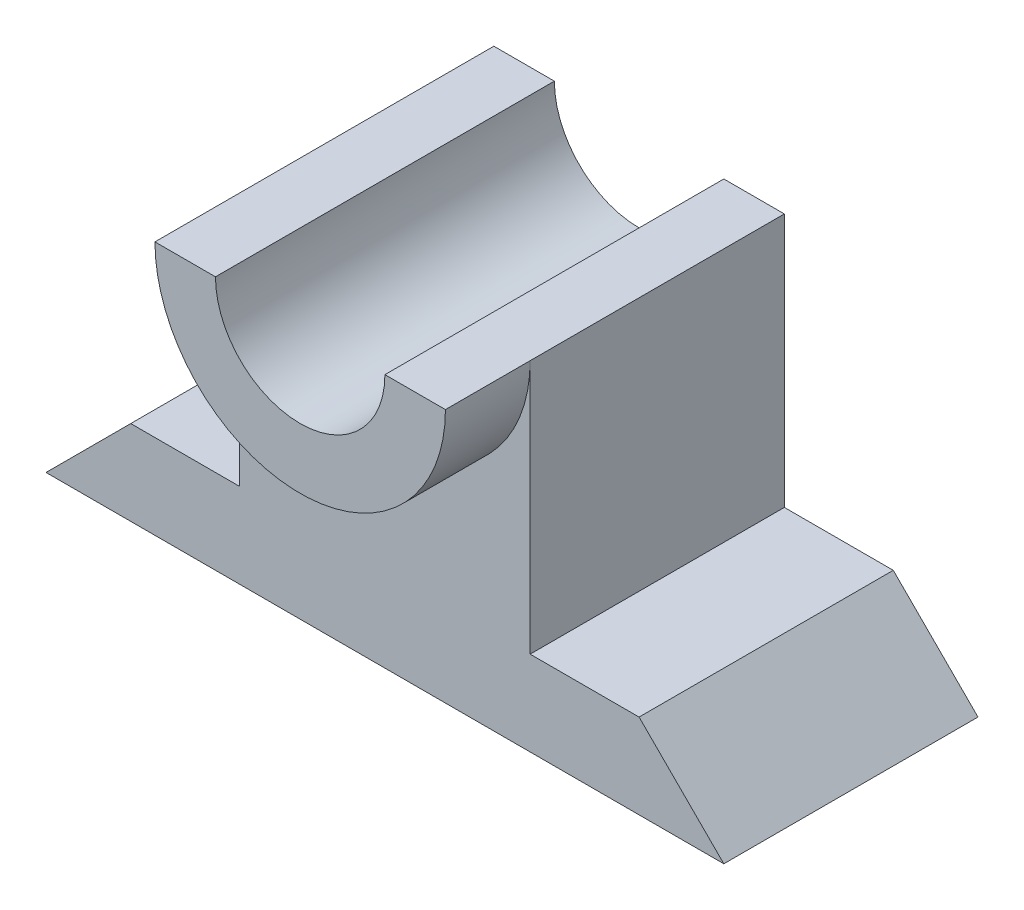
ISO-10303-21;
HEADER;
FILE_DESCRIPTION(('STEP AP214'),'2;1');
FILE_NAME('part.step','',(''),(''),'','','');
FILE_SCHEMA(('AUTOMOTIVE_DESIGN { 1 0 10303 214 1 1 1 1 }'));
ENDSEC;
DATA;
#1=APPLICATION_CONTEXT('core data for automotive mechanical design processes');
#2=APPLICATION_PROTOCOL_DEFINITION('international standard','automotive_design',2000,#1);
#3=PRODUCT_CONTEXT('',#1,'mechanical');
#4=PRODUCT('Part','Part','',(#3));
#5=PRODUCT_RELATED_PRODUCT_CATEGORY('part','',(#4));
#6=PRODUCT_DEFINITION_FORMATION('','',#4);
#7=PRODUCT_DEFINITION_CONTEXT('part definition',#1,'design');
#8=PRODUCT_DEFINITION('design','',#6,#7);
#9=PRODUCT_DEFINITION_SHAPE('','',#8);
#10=(LENGTH_UNIT() NAMED_UNIT(*) SI_UNIT(.MILLI.,.METRE.));
#11=(NAMED_UNIT(*) PLANE_ANGLE_UNIT() SI_UNIT($,.RADIAN.));
#12=(NAMED_UNIT(*) SI_UNIT($,.STERADIAN.) SOLID_ANGLE_UNIT());
#13=UNCERTAINTY_MEASURE_WITH_UNIT(LENGTH_MEASURE(1.E-05),#10,'distance_accuracy_value','');
#14=(GEOMETRIC_REPRESENTATION_CONTEXT(3) GLOBAL_UNCERTAINTY_ASSIGNED_CONTEXT((#13)) GLOBAL_UNIT_ASSIGNED_CONTEXT((#10,
#11,#12)) REPRESENTATION_CONTEXT('',''));
#15=CARTESIAN_POINT('',(0.,0.,0.));
#16=DIRECTION('',(0.,0.,1.));
#17=DIRECTION('',(1.,0.,0.));
#18=AXIS2_PLACEMENT_3D('',#15,#16,#17);
#19=CARTESIAN_POINT('',(17.1428571428571,0.,-30.));
#20=DIRECTION('',(1.,0.,0.));
#21=DIRECTION('',(0.,1.,0.));
#22=AXIS2_PLACEMENT_3D('',#19,#20,#21);
#23=PLANE('',#22);
#24=DIRECTION('',(0.,1.,0.));
#25=VECTOR('',#24,1.);
#26=CARTESIAN_POINT('',(17.1428571428571,0.,0.));
#27=LINE('',#26,#25);
#28=CARTESIAN_POINT('',(17.1428571428571,9.99999999999998,0.));
#29=VERTEX_POINT('',#28);
#30=CARTESIAN_POINT('',(17.1428571428572,40.,0.));
#31=VERTEX_POINT('',#30);
#32=EDGE_CURVE('E149',#29,#31,#27,.T.);
#33=ORIENTED_EDGE('',*,*,#32,.F.);
#34=DIRECTION('',(0.,0.,1.));
#35=VECTOR('',#34,1.);
#36=CARTESIAN_POINT('',(17.1428571428571,9.99999999999998,-30.));
#37=LINE('',#36,#35);
#38=CARTESIAN_POINT('',(17.1428571428571,9.99999999999998,-30.));
#39=VERTEX_POINT('',#38);
#40=EDGE_CURVE('E11',#39,#29,#37,.T.);
#41=ORIENTED_EDGE('',*,*,#40,.F.);
#42=DIRECTION('',(0.,1.,0.));
#43=VECTOR('',#42,1.);
#44=CARTESIAN_POINT('',(17.1428571428571,0.,-30.));
#45=LINE('',#44,#43);
#46=CARTESIAN_POINT('',(17.1428571428572,40.,-30.));
#47=VERTEX_POINT('',#46);
#48=EDGE_CURVE('E172',#39,#47,#45,.T.);
#49=ORIENTED_EDGE('',*,*,#48,.T.);
#50=DIRECTION('',(0.,0.,1.));
#51=VECTOR('',#50,1.);
#52=CARTESIAN_POINT('',(17.1428571428572,40.,-30.));
#53=LINE('',#52,#51);
#54=EDGE_CURVE('E42',#47,#31,#53,.T.);
#55=ORIENTED_EDGE('',*,*,#54,.T.);
#56=EDGE_LOOP('',(#33,#41,#49,#55));
#57=FACE_BOUND('',#56,.T.);
#58=ADVANCED_FACE('F39',(#57),#23,.T.);
#59=CARTESIAN_POINT('',(0.,9.99999999999999,-30.));
#60=DIRECTION('',(0.,1.,0.));
#61=DIRECTION('',(-1.,0.,0.));
#62=AXIS2_PLACEMENT_3D('',#59,#60,#61);
#63=PLANE('',#62);
#64=DIRECTION('',(-1.,0.,0.));
#65=VECTOR('',#64,1.);
#66=CARTESIAN_POINT('',(0.,9.99999999999999,0.));
#67=LINE('',#66,#65);
#68=CARTESIAN_POINT('',(30.,9.99999999999997,0.));
#69=VERTEX_POINT('',#68);
#70=EDGE_CURVE('E169',#69,#29,#67,.T.);
#71=ORIENTED_EDGE('',*,*,#70,.F.);
#72=DIRECTION('',(0.,0.,1.));
#73=VECTOR('',#72,1.);
#74=CARTESIAN_POINT('',(30.,9.99999999999997,-30.));
#75=LINE('',#74,#73);
#76=CARTESIAN_POINT('',(30.,9.99999999999997,-30.));
#77=VERTEX_POINT('',#76);
#78=EDGE_CURVE('E49',#77,#69,#75,.T.);
#79=ORIENTED_EDGE('',*,*,#78,.F.);
#80=DIRECTION('',(-1.,0.,0.));
#81=VECTOR('',#80,1.);
#82=CARTESIAN_POINT('',(0.,9.99999999999999,-30.));
#83=LINE('',#82,#81);
#84=EDGE_CURVE('E134',#77,#39,#83,.T.);
#85=ORIENTED_EDGE('',*,*,#84,.T.);
#86=ORIENTED_EDGE('',*,*,#40,.T.);
#87=EDGE_LOOP('',(#71,#79,#85,#86));
#88=FACE_BOUND('',#87,.T.);
#89=ADVANCED_FACE('F281',(#88),#63,.T.);
#90=CARTESIAN_POINT('',(19.9999999999999,20.,-30.));
#91=DIRECTION('',(0.707106781186546,0.707106781186549,0.));
#92=DIRECTION('',(-0.707106781186549,0.707106781186546,0.));
#93=AXIS2_PLACEMENT_3D('',#90,#91,#92);
#94=PLANE('',#93);
#95=DIRECTION('',(-0.707106781186549,0.707106781186546,0.));
#96=VECTOR('',#95,1.);
#97=CARTESIAN_POINT('',(19.9999999999999,20.,0.));
#98=LINE('',#97,#96);
#99=CARTESIAN_POINT('',(40.,0.,0.));
#100=VERTEX_POINT('',#99);
#101=EDGE_CURVE('E122',#100,#69,#98,.T.);
#102=ORIENTED_EDGE('',*,*,#101,.F.);
#103=DIRECTION('',(0.,0.,1.));
#104=VECTOR('',#103,1.);
#105=CARTESIAN_POINT('',(40.,0.,-30.));
#106=LINE('',#105,#104);
#107=CARTESIAN_POINT('',(40.,0.,-30.));
#108=VERTEX_POINT('',#107);
#109=EDGE_CURVE('E117',#108,#100,#106,.T.);
#110=ORIENTED_EDGE('',*,*,#109,.F.);
#111=DIRECTION('',(-0.707106781186549,0.707106781186546,0.));
#112=VECTOR('',#111,1.);
#113=CARTESIAN_POINT('',(19.9999999999999,20.,-30.));
#114=LINE('',#113,#112);
#115=EDGE_CURVE('E120',#108,#77,#114,.T.);
#116=ORIENTED_EDGE('',*,*,#115,.T.);
#117=ORIENTED_EDGE('',*,*,#78,.T.);
#118=EDGE_LOOP('',(#102,#110,#116,#117));
#119=FACE_BOUND('',#118,.T.);
#120=ADVANCED_FACE('F119',(#119),#94,.T.);
#121=CARTESIAN_POINT('',(0.,0.,-30.));
#122=DIRECTION('',(0.,-1.,0.));
#123=DIRECTION('',(0.,0.,-1.));
#124=AXIS2_PLACEMENT_3D('',#121,#122,#123);
#125=PLANE('',#124);
#126=DIRECTION('',(1.,0.,0.));
#127=VECTOR('',#126,1.);
#128=CARTESIAN_POINT('',(0.,0.,0.));
#129=LINE('',#128,#127);
#130=CARTESIAN_POINT('',(-40.,0.,0.));
#131=VERTEX_POINT('',#130);
#132=EDGE_CURVE('E164',#131,#100,#129,.T.);
#133=ORIENTED_EDGE('',*,*,#132,.F.);
#134=DIRECTION('',(0.,0.,1.));
#135=VECTOR('',#134,1.);
#136=CARTESIAN_POINT('',(-40.,0.,-30.));
#137=LINE('',#136,#135);
#138=CARTESIAN_POINT('',(-40.,0.,-30.));
#139=VERTEX_POINT('',#138);
#140=EDGE_CURVE('E128',#139,#131,#137,.T.);
#141=ORIENTED_EDGE('',*,*,#140,.F.);
#142=DIRECTION('',(1.,0.,0.));
#143=VECTOR('',#142,1.);
#144=CARTESIAN_POINT('',(0.,0.,-30.));
#145=LINE('',#144,#143);
#146=EDGE_CURVE('E133',#139,#108,#145,.T.);
#147=ORIENTED_EDGE('',*,*,#146,.T.);
#148=ORIENTED_EDGE('',*,*,#109,.T.);
#149=EDGE_LOOP('',(#133,#141,#147,#148));
#150=FACE_BOUND('',#149,.T.);
#151=ADVANCED_FACE('F137',(#150),#125,.T.);
#152=CARTESIAN_POINT('',(-19.9999999999999,20.,-30.));
#153=DIRECTION('',(0.707106781186546,-0.707106781186549,0.));
#154=DIRECTION('',(0.707106781186549,0.707106781186546,0.));
#155=AXIS2_PLACEMENT_3D('',#152,#153,#154);
#156=PLANE('',#155);
#157=DIRECTION('',(0.707106781186549,0.707106781186546,0.));
#158=VECTOR('',#157,1.);
#159=CARTESIAN_POINT('',(-19.9999999999999,20.,0.));
#160=LINE('',#159,#158);
#161=CARTESIAN_POINT('',(-30.,9.99999999999997,0.));
#162=VERTEX_POINT('',#161);
#163=EDGE_CURVE('E161',#131,#162,#160,.T.);
#164=ORIENTED_EDGE('',*,*,#163,.T.);
#165=DIRECTION('',(0.,0.,1.));
#166=VECTOR('',#165,1.);
#167=CARTESIAN_POINT('',(-30.,9.99999999999997,-30.));
#168=LINE('',#167,#166);
#169=CARTESIAN_POINT('',(-30.,9.99999999999997,-30.));
#170=VERTEX_POINT('',#169);
#171=EDGE_CURVE('E178',#170,#162,#168,.T.);
#172=ORIENTED_EDGE('',*,*,#171,.F.);
#173=DIRECTION('',(0.707106781186549,0.707106781186546,0.));
#174=VECTOR('',#173,1.);
#175=CARTESIAN_POINT('',(-19.9999999999999,20.,-30.));
#176=LINE('',#175,#174);
#177=EDGE_CURVE('E140',#139,#170,#176,.T.);
#178=ORIENTED_EDGE('',*,*,#177,.F.);
#179=ORIENTED_EDGE('',*,*,#140,.T.);
#180=EDGE_LOOP('',(#164,#172,#178,#179));
#181=FACE_BOUND('',#180,.T.);
#182=ADVANCED_FACE('F295',(#181),#156,.F.);
#183=CARTESIAN_POINT('',(0.,9.99999999999999,-30.));
#184=DIRECTION('',(0.,-1.,0.));
#185=DIRECTION('',(1.,0.,0.));
#186=AXIS2_PLACEMENT_3D('',#183,#184,#185);
#187=PLANE('',#186);
#188=DIRECTION('',(1.,0.,0.));
#189=VECTOR('',#188,1.);
#190=CARTESIAN_POINT('',(0.,9.99999999999999,0.));
#191=LINE('',#190,#189);
#192=CARTESIAN_POINT('',(-17.1428571428571,9.99999999999998,0.));
#193=VERTEX_POINT('',#192);
#194=EDGE_CURVE('E158',#162,#193,#191,.T.);
#195=ORIENTED_EDGE('',*,*,#194,.T.);
#196=DIRECTION('',(0.,0.,1.));
#197=VECTOR('',#196,1.);
#198=CARTESIAN_POINT('',(-17.1428571428571,9.99999999999998,-30.));
#199=LINE('',#198,#197);
#200=CARTESIAN_POINT('',(-17.1428571428571,9.99999999999998,-30.));
#201=VERTEX_POINT('',#200);
#202=EDGE_CURVE('E182',#201,#193,#199,.T.);
#203=ORIENTED_EDGE('',*,*,#202,.F.);
#204=DIRECTION('',(1.,0.,0.));
#205=VECTOR('',#204,1.);
#206=CARTESIAN_POINT('',(0.,9.99999999999999,-30.));
#207=LINE('',#206,#205);
#208=EDGE_CURVE('E143',#170,#201,#207,.T.);
#209=ORIENTED_EDGE('',*,*,#208,.F.);
#210=ORIENTED_EDGE('',*,*,#171,.T.);
#211=EDGE_LOOP('',(#195,#203,#209,#210));
#212=FACE_BOUND('',#211,.T.);
#213=ADVANCED_FACE('F247',(#212),#187,.F.);
#214=CARTESIAN_POINT('',(-17.1428571428571,0.,-30.));
#215=DIRECTION('',(1.,0.,0.));
#216=DIRECTION('',(0.,1.,0.));
#217=AXIS2_PLACEMENT_3D('',#214,#215,#216);
#218=PLANE('',#217);
#219=DIRECTION('',(0.,1.,0.));
#220=VECTOR('',#219,1.);
#221=CARTESIAN_POINT('',(-17.1428571428571,0.,0.));
#222=LINE('',#221,#220);
#223=CARTESIAN_POINT('',(-17.1428571428572,40.,0.));
#224=VERTEX_POINT('',#223);
#225=EDGE_CURVE('E153',#193,#224,#222,.T.);
#226=ORIENTED_EDGE('',*,*,#225,.T.);
#227=DIRECTION('',(0.,0.,1.));
#228=VECTOR('',#227,1.);
#229=CARTESIAN_POINT('',(-17.1428571428572,40.,-30.));
#230=LINE('',#229,#228);
#231=CARTESIAN_POINT('',(-17.1428571428572,40.,-30.));
#232=VERTEX_POINT('',#231);
#233=EDGE_CURVE('E186',#232,#224,#230,.T.);
#234=ORIENTED_EDGE('',*,*,#233,.F.);
#235=DIRECTION('',(0.,1.,0.));
#236=VECTOR('',#235,1.);
#237=CARTESIAN_POINT('',(-17.1428571428571,0.,-30.));
#238=LINE('',#237,#236);
#239=EDGE_CURVE('E237',#201,#232,#238,.T.);
#240=ORIENTED_EDGE('',*,*,#239,.F.);
#241=ORIENTED_EDGE('',*,*,#202,.T.);
#242=EDGE_LOOP('',(#226,#234,#240,#241));
#243=FACE_BOUND('',#242,.T.);
#244=ADVANCED_FACE('F250',(#243),#218,.F.);
#245=CARTESIAN_POINT('',(0.,40.,-30.));
#246=DIRECTION('',(0.,1.,0.));
#247=DIRECTION('',(0.,0.,1.));
#248=AXIS2_PLACEMENT_3D('',#245,#246,#247);
#249=PLANE('',#248);
#250=ORIENTED_EDGE('',*,*,#233,.T.);
#251=DIRECTION('',(0.,0.,-1.));
#252=VECTOR('',#251,1.);
#253=CARTESIAN_POINT('',(-17.1428571428572,40.,10.));
#254=LINE('',#253,#252);
#255=CARTESIAN_POINT('',(-17.1428571428572,40.,10.));
#256=VERTEX_POINT('',#255);
#257=EDGE_CURVE('E154',#256,#224,#254,.T.);
#258=ORIENTED_EDGE('',*,*,#257,.F.);
#259=DIRECTION('',(-1.,0.,0.));
#260=VECTOR('',#259,1.);
#261=CARTESIAN_POINT('',(0.,40.,10.));
#262=LINE('',#261,#260);
#263=CARTESIAN_POINT('',(-10.,40.,10.));
#264=VERTEX_POINT('',#263);
#265=EDGE_CURVE('E214',#264,#256,#262,.T.);
#266=ORIENTED_EDGE('',*,*,#265,.F.);
#267=DIRECTION('',(0.,0.,1.));
#268=VECTOR('',#267,1.);
#269=CARTESIAN_POINT('',(-10.,40.,-30.));
#270=LINE('',#269,#268);
#271=CARTESIAN_POINT('',(-10.,40.,-30.));
#272=VERTEX_POINT('',#271);
#273=EDGE_CURVE('E190',#272,#264,#270,.T.);
#274=ORIENTED_EDGE('',*,*,#273,.F.);
#275=DIRECTION('',(-1.,0.,0.));
#276=VECTOR('',#275,1.);
#277=CARTESIAN_POINT('',(0.,40.,-30.));
#278=LINE('',#277,#276);
#279=EDGE_CURVE('E233',#272,#232,#278,.T.);
#280=ORIENTED_EDGE('',*,*,#279,.T.);
#281=EDGE_LOOP('',(#250,#258,#266,#274,#280));
#282=FACE_BOUND('',#281,.T.);
#283=ADVANCED_FACE('F253',(#282),#249,.T.);
#284=CARTESIAN_POINT('',(0.,40.,-30.));
#285=DIRECTION('',(0.,0.,1.));
#286=DIRECTION('',(1.,0.,0.));
#287=AXIS2_PLACEMENT_3D('',#284,#285,#286);
#288=CYLINDRICAL_SURFACE('',#287,10.);
#289=ORIENTED_EDGE('',*,*,#273,.T.);
#290=CARTESIAN_POINT('',(0.,40.,10.));
#291=DIRECTION('',(0.,0.,1.));
#292=DIRECTION('',(1.,0.,0.));
#293=AXIS2_PLACEMENT_3D('',#290,#291,#292);
#294=CIRCLE('',#293,10.);
#295=CARTESIAN_POINT('',(10.,40.,10.));
#296=VERTEX_POINT('',#295);
#297=EDGE_CURVE('E219',#296,#264,#294,.F.);
#298=ORIENTED_EDGE('',*,*,#297,.F.);
#299=DIRECTION('',(0.,0.,1.));
#300=VECTOR('',#299,1.);
#301=CARTESIAN_POINT('',(10.,40.,-30.));
#302=LINE('',#301,#300);
#303=CARTESIAN_POINT('',(10.,40.,-30.));
#304=VERTEX_POINT('',#303);
#305=EDGE_CURVE('E193',#304,#296,#302,.T.);
#306=ORIENTED_EDGE('',*,*,#305,.F.);
#307=CARTESIAN_POINT('',(0.,40.,-30.));
#308=DIRECTION('',(0.,0.,1.));
#309=DIRECTION('',(1.,0.,0.));
#310=AXIS2_PLACEMENT_3D('',#307,#308,#309);
#311=CIRCLE('',#310,10.);
#312=EDGE_CURVE('E232',#304,#272,#311,.F.);
#313=ORIENTED_EDGE('',*,*,#312,.T.);
#314=EDGE_LOOP('',(#289,#298,#306,#313));
#315=FACE_BOUND('',#314,.T.);
#316=ADVANCED_FACE('F258',(#315),#288,.F.);
#317=ORIENTED_EDGE('',*,*,#305,.T.);
#318=CARTESIAN_POINT('',(17.1428571428572,40.,10.));
#319=VERTEX_POINT('',#318);
#320=EDGE_CURVE('E217',#319,#296,#262,.T.);
#321=ORIENTED_EDGE('',*,*,#320,.F.);
#322=DIRECTION('',(0.,0.,-1.));
#323=VECTOR('',#322,1.);
#324=CARTESIAN_POINT('',(17.1428571428572,40.,10.));
#325=LINE('',#324,#323);
#326=EDGE_CURVE('E209',#319,#31,#325,.T.);
#327=ORIENTED_EDGE('',*,*,#326,.T.);
#328=ORIENTED_EDGE('',*,*,#54,.F.);
#329=EDGE_CURVE('E229',#47,#304,#278,.T.);
#330=ORIENTED_EDGE('',*,*,#329,.T.);
#331=EDGE_LOOP('',(#317,#321,#327,#328,#330));
#332=FACE_BOUND('',#331,.T.);
#333=ADVANCED_FACE('F216',(#332),#249,.T.);
#334=CARTESIAN_POINT('',(0.,0.,-30.));
#335=DIRECTION('',(0.,0.,1.));
#336=DIRECTION('',(1.,0.,0.));
#337=AXIS2_PLACEMENT_3D('',#334,#335,#336);
#338=PLANE('',#337);
#339=ORIENTED_EDGE('',*,*,#48,.F.);
#340=ORIENTED_EDGE('',*,*,#84,.F.);
#341=ORIENTED_EDGE('',*,*,#115,.F.);
#342=ORIENTED_EDGE('',*,*,#146,.F.);
#343=ORIENTED_EDGE('',*,*,#177,.T.);
#344=ORIENTED_EDGE('',*,*,#208,.T.);
#345=ORIENTED_EDGE('',*,*,#239,.T.);
#346=ORIENTED_EDGE('',*,*,#279,.F.);
#347=ORIENTED_EDGE('',*,*,#312,.F.);
#348=ORIENTED_EDGE('',*,*,#329,.F.);
#349=EDGE_LOOP('',(#339,#340,#341,#342,#343,#344,#345,#346,#347,#348));
#350=FACE_BOUND('',#349,.T.);
#351=ADVANCED_FACE('F132',(#350),#338,.F.);
#352=CARTESIAN_POINT('',(0.,0.,0.));
#353=DIRECTION('',(0.,0.,1.));
#354=DIRECTION('',(1.,0.,0.));
#355=AXIS2_PLACEMENT_3D('',#352,#353,#354);
#356=PLANE('',#355);
#357=CARTESIAN_POINT('',(0.,40.,0.));
#358=DIRECTION('',(0.,0.,1.));
#359=DIRECTION('',(1.,0.,0.));
#360=AXIS2_PLACEMENT_3D('',#357,#358,#359);
#361=CIRCLE('',#360,17.1428571428572);
#362=EDGE_CURVE('E205',#224,#31,#361,.T.);
#363=ORIENTED_EDGE('',*,*,#362,.F.);
#364=ORIENTED_EDGE('',*,*,#225,.F.);
#365=ORIENTED_EDGE('',*,*,#194,.F.);
#366=ORIENTED_EDGE('',*,*,#163,.F.);
#367=ORIENTED_EDGE('',*,*,#132,.T.);
#368=ORIENTED_EDGE('',*,*,#101,.T.);
#369=ORIENTED_EDGE('',*,*,#70,.T.);
#370=ORIENTED_EDGE('',*,*,#32,.T.);
#371=EDGE_LOOP('',(#363,#364,#365,#366,#367,#368,#369,#370));
#372=FACE_BOUND('',#371,.T.);
#373=ADVANCED_FACE('F278',(#372),#356,.T.);
#374=CARTESIAN_POINT('',(0.,40.,10.));
#375=DIRECTION('',(0.,0.,-1.));
#376=DIRECTION('',(-1.,0.,0.));
#377=AXIS2_PLACEMENT_3D('',#374,#375,#376);
#378=CYLINDRICAL_SURFACE('',#377,17.1428571428572);
#379=ORIENTED_EDGE('',*,*,#362,.T.);
#380=ORIENTED_EDGE('',*,*,#326,.F.);
#381=CARTESIAN_POINT('',(0.,40.,10.));
#382=DIRECTION('',(0.,0.,1.));
#383=DIRECTION('',(1.,0.,0.));
#384=AXIS2_PLACEMENT_3D('',#381,#382,#383);
#385=CIRCLE('',#384,17.1428571428572);
#386=EDGE_CURVE('E266',#256,#319,#385,.T.);
#387=ORIENTED_EDGE('',*,*,#386,.F.);
#388=ORIENTED_EDGE('',*,*,#257,.T.);
#389=EDGE_LOOP('',(#379,#380,#387,#388));
#390=FACE_BOUND('',#389,.T.);
#391=ADVANCED_FACE('F206',(#390),#378,.T.);
#392=CARTESIAN_POINT('',(0.,0.,10.));
#393=DIRECTION('',(0.,0.,1.));
#394=DIRECTION('',(1.,0.,0.));
#395=AXIS2_PLACEMENT_3D('',#392,#393,#394);
#396=PLANE('',#395);
#397=ORIENTED_EDGE('',*,*,#265,.T.);
#398=ORIENTED_EDGE('',*,*,#386,.T.);
#399=ORIENTED_EDGE('',*,*,#320,.T.);
#400=ORIENTED_EDGE('',*,*,#297,.T.);
#401=EDGE_LOOP('',(#397,#398,#399,#400));
#402=FACE_BOUND('',#401,.T.);
#403=ADVANCED_FACE('F263',(#402),#396,.T.);
#404=CLOSED_SHELL('',(#58,#89,#120,#151,#182,#213,#244,#283,#316,#333,#351,#373,#391,#403));
#405=MANIFOLD_SOLID_BREP('B2',#404);
#406=ADVANCED_BREP_SHAPE_REPRESENTATION('',(#18,#405),#14);
#407=SHAPE_DEFINITION_REPRESENTATION(#9,#406);
ENDSEC;
END-ISO-10303-21;
